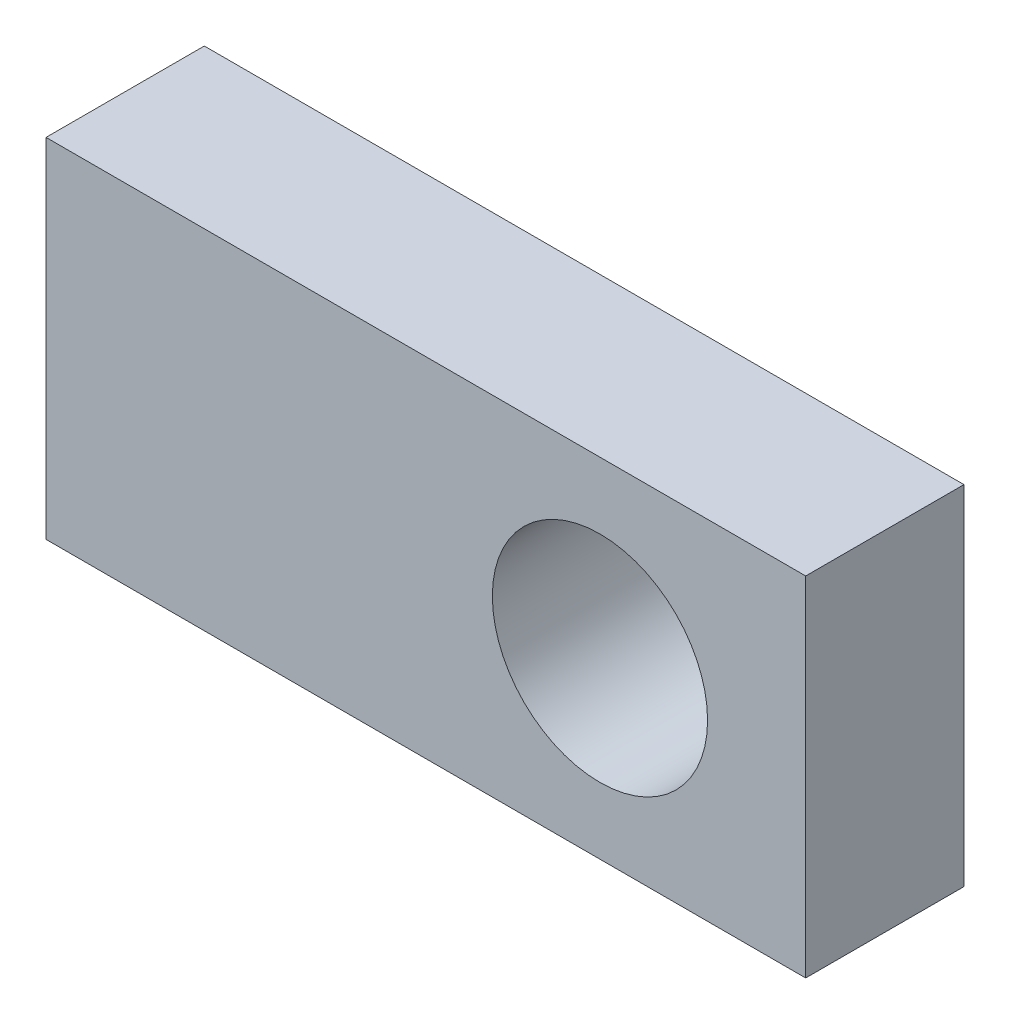
ISO-10303-21;
HEADER;
FILE_DESCRIPTION(('STEP AP214'),'2;1');
FILE_NAME('part.step','',(''),(''),'','','');
FILE_SCHEMA(('AUTOMOTIVE_DESIGN { 1 0 10303 214 1 1 1 1 }'));
ENDSEC;
DATA;
#1=APPLICATION_CONTEXT('core data for automotive mechanical design processes');
#2=APPLICATION_PROTOCOL_DEFINITION('international standard','automotive_design',2000,#1);
#3=PRODUCT_CONTEXT('',#1,'mechanical');
#4=PRODUCT('Part','Part','',(#3));
#5=PRODUCT_RELATED_PRODUCT_CATEGORY('part','',(#4));
#6=PRODUCT_DEFINITION_FORMATION('','',#4);
#7=PRODUCT_DEFINITION_CONTEXT('part definition',#1,'design');
#8=PRODUCT_DEFINITION('design','',#6,#7);
#9=PRODUCT_DEFINITION_SHAPE('','',#8);
#10=(LENGTH_UNIT() NAMED_UNIT(*) SI_UNIT(.MILLI.,.METRE.));
#11=(NAMED_UNIT(*) PLANE_ANGLE_UNIT() SI_UNIT($,.RADIAN.));
#12=(NAMED_UNIT(*) SI_UNIT($,.STERADIAN.) SOLID_ANGLE_UNIT());
#13=UNCERTAINTY_MEASURE_WITH_UNIT(LENGTH_MEASURE(1.E-05),#10,'distance_accuracy_value','');
#14=(GEOMETRIC_REPRESENTATION_CONTEXT(3) GLOBAL_UNCERTAINTY_ASSIGNED_CONTEXT((#13)) GLOBAL_UNIT_ASSIGNED_CONTEXT((#10,
#11,#12)) REPRESENTATION_CONTEXT('',''));
#15=CARTESIAN_POINT('',(0.,0.,0.));
#16=DIRECTION('',(0.,0.,1.));
#17=DIRECTION('',(1.,0.,0.));
#18=AXIS2_PLACEMENT_3D('',#15,#16,#17);
#19=CARTESIAN_POINT('',(0.,-5.49999999999999,5.));
#20=DIRECTION('',(0.,0.,-1.));
#21=DIRECTION('',(-1.,0.,0.));
#22=AXIS2_PLACEMENT_3D('',#19,#20,#21);
#23=PLANE('',#22);
#24=DIRECTION('',(0.,1.,0.));
#25=VECTOR('',#24,1.);
#26=CARTESIAN_POINT('',(0.,5.50000000000002,5.));
#27=LINE('',#26,#25);
#28=CARTESIAN_POINT('',(0.,-5.49999999999999,5.));
#29=VERTEX_POINT('',#28);
#30=CARTESIAN_POINT('',(0.,5.50000000000002,5.));
#31=VERTEX_POINT('',#30);
#32=EDGE_CURVE('E86',#29,#31,#27,.T.);
#33=ORIENTED_EDGE('',*,*,#32,.T.);
#34=DIRECTION('',(-1.,0.,0.));
#35=VECTOR('',#34,1.);
#36=CARTESIAN_POINT('',(0.,5.50000000000002,5.));
#37=LINE('',#36,#35);
#38=CARTESIAN_POINT('',(-24.,5.50000000000003,5.));
#39=VERTEX_POINT('',#38);
#40=EDGE_CURVE('E81',#31,#39,#37,.T.);
#41=ORIENTED_EDGE('',*,*,#40,.T.);
#42=DIRECTION('',(0.,-1.,0.));
#43=VECTOR('',#42,1.);
#44=CARTESIAN_POINT('',(-24.,5.50000000000003,5.));
#45=LINE('',#44,#43);
#46=CARTESIAN_POINT('',(-24.,-5.49999999999998,5.));
#47=VERTEX_POINT('',#46);
#48=EDGE_CURVE('E84',#39,#47,#45,.T.);
#49=ORIENTED_EDGE('',*,*,#48,.T.);
#50=DIRECTION('',(1.,0.,0.));
#51=VECTOR('',#50,1.);
#52=CARTESIAN_POINT('',(0.,-5.49999999999999,5.));
#53=LINE('',#52,#51);
#54=EDGE_CURVE('E51',#47,#29,#53,.T.);
#55=ORIENTED_EDGE('',*,*,#54,.T.);
#56=EDGE_LOOP('',(#33,#41,#49,#55));
#57=FACE_BOUND('',#56,.T.);
#58=CARTESIAN_POINT('',(-6.5,0.,5.));
#59=DIRECTION('',(0.,0.,1.));
#60=DIRECTION('',(1.,0.,0.));
#61=AXIS2_PLACEMENT_3D('',#58,#59,#60);
#62=CIRCLE('',#61,3.4);
#63=CARTESIAN_POINT('',(-3.1,0.,5.));
#64=VERTEX_POINT('',#63);
#65=EDGE_CURVE('E101',#64,#64,#62,.T.);
#66=ORIENTED_EDGE('',*,*,#65,.F.);
#67=EDGE_LOOP('',(#66));
#68=FACE_BOUND('',#67,.T.);
#69=ADVANCED_FACE('F34',(#57,#68),#23,.F.);
#70=CARTESIAN_POINT('',(0.,-5.49999999999999,0.));
#71=DIRECTION('',(0.,0.,-1.));
#72=DIRECTION('',(-1.,0.,0.));
#73=AXIS2_PLACEMENT_3D('',#70,#71,#72);
#74=PLANE('',#73);
#75=DIRECTION('',(0.,1.,0.));
#76=VECTOR('',#75,1.);
#77=CARTESIAN_POINT('',(0.,5.50000000000002,0.));
#78=LINE('',#77,#76);
#79=CARTESIAN_POINT('',(0.,-5.49999999999999,0.));
#80=VERTEX_POINT('',#79);
#81=CARTESIAN_POINT('',(0.,5.50000000000002,0.));
#82=VERTEX_POINT('',#81);
#83=EDGE_CURVE('E98',#80,#82,#78,.T.);
#84=ORIENTED_EDGE('',*,*,#83,.F.);
#85=DIRECTION('',(1.,0.,0.));
#86=VECTOR('',#85,1.);
#87=CARTESIAN_POINT('',(0.,-5.49999999999999,0.));
#88=LINE('',#87,#86);
#89=CARTESIAN_POINT('',(-24.,-5.49999999999998,0.));
#90=VERTEX_POINT('',#89);
#91=EDGE_CURVE('E74',#90,#80,#88,.T.);
#92=ORIENTED_EDGE('',*,*,#91,.F.);
#93=DIRECTION('',(0.,-1.,0.));
#94=VECTOR('',#93,1.);
#95=CARTESIAN_POINT('',(-24.,5.50000000000003,0.));
#96=LINE('',#95,#94);
#97=CARTESIAN_POINT('',(-24.,5.50000000000003,0.));
#98=VERTEX_POINT('',#97);
#99=EDGE_CURVE('E68',#98,#90,#96,.T.);
#100=ORIENTED_EDGE('',*,*,#99,.F.);
#101=DIRECTION('',(-1.,0.,0.));
#102=VECTOR('',#101,1.);
#103=CARTESIAN_POINT('',(0.,5.50000000000002,0.));
#104=LINE('',#103,#102);
#105=EDGE_CURVE('E90',#82,#98,#104,.T.);
#106=ORIENTED_EDGE('',*,*,#105,.F.);
#107=EDGE_LOOP('',(#84,#92,#100,#106));
#108=FACE_BOUND('',#107,.T.);
#109=CARTESIAN_POINT('',(-6.5,0.,0.));
#110=DIRECTION('',(0.,0.,1.));
#111=DIRECTION('',(1.,0.,0.));
#112=AXIS2_PLACEMENT_3D('',#109,#110,#111);
#113=CIRCLE('',#112,3.4);
#114=CARTESIAN_POINT('',(-3.1,0.,0.));
#115=VERTEX_POINT('',#114);
#116=EDGE_CURVE('E113',#115,#115,#113,.T.);
#117=ORIENTED_EDGE('',*,*,#116,.T.);
#118=EDGE_LOOP('',(#117));
#119=FACE_BOUND('',#118,.T.);
#120=ADVANCED_FACE('F109',(#108,#119),#74,.T.);
#121=CARTESIAN_POINT('',(0.,5.50000000000002,5.));
#122=DIRECTION('',(-1.,0.,0.));
#123=DIRECTION('',(0.,-1.,0.));
#124=AXIS2_PLACEMENT_3D('',#121,#122,#123);
#125=PLANE('',#124);
#126=ORIENTED_EDGE('',*,*,#83,.T.);
#127=DIRECTION('',(0.,0.,-1.));
#128=VECTOR('',#127,1.);
#129=CARTESIAN_POINT('',(0.,5.50000000000002,5.));
#130=LINE('',#129,#128);
#131=EDGE_CURVE('E11',#31,#82,#130,.T.);
#132=ORIENTED_EDGE('',*,*,#131,.F.);
#133=ORIENTED_EDGE('',*,*,#32,.F.);
#134=DIRECTION('',(0.,0.,-1.));
#135=VECTOR('',#134,1.);
#136=CARTESIAN_POINT('',(0.,-5.49999999999999,5.));
#137=LINE('',#136,#135);
#138=EDGE_CURVE('E94',#29,#80,#137,.T.);
#139=ORIENTED_EDGE('',*,*,#138,.T.);
#140=EDGE_LOOP('',(#126,#132,#133,#139));
#141=FACE_BOUND('',#140,.T.);
#142=ADVANCED_FACE('F36',(#141),#125,.F.);
#143=CARTESIAN_POINT('',(0.,5.50000000000002,5.));
#144=DIRECTION('',(0.,-1.,0.));
#145=DIRECTION('',(1.,0.,0.));
#146=AXIS2_PLACEMENT_3D('',#143,#144,#145);
#147=PLANE('',#146);
#148=ORIENTED_EDGE('',*,*,#105,.T.);
#149=DIRECTION('',(0.,0.,-1.));
#150=VECTOR('',#149,1.);
#151=CARTESIAN_POINT('',(-24.,5.50000000000003,5.));
#152=LINE('',#151,#150);
#153=EDGE_CURVE('E43',#39,#98,#152,.T.);
#154=ORIENTED_EDGE('',*,*,#153,.F.);
#155=ORIENTED_EDGE('',*,*,#40,.F.);
#156=ORIENTED_EDGE('',*,*,#131,.T.);
#157=EDGE_LOOP('',(#148,#154,#155,#156));
#158=FACE_BOUND('',#157,.T.);
#159=ADVANCED_FACE('F89',(#158),#147,.F.);
#160=CARTESIAN_POINT('',(-24.,5.50000000000003,5.));
#161=DIRECTION('',(1.,0.,0.));
#162=DIRECTION('',(0.,0.,-1.));
#163=AXIS2_PLACEMENT_3D('',#160,#161,#162);
#164=PLANE('',#163);
#165=ORIENTED_EDGE('',*,*,#99,.T.);
#166=DIRECTION('',(0.,0.,-1.));
#167=VECTOR('',#166,1.);
#168=CARTESIAN_POINT('',(-24.,-5.49999999999998,5.));
#169=LINE('',#168,#167);
#170=EDGE_CURVE('E91',#47,#90,#169,.T.);
#171=ORIENTED_EDGE('',*,*,#170,.F.);
#172=ORIENTED_EDGE('',*,*,#48,.F.);
#173=ORIENTED_EDGE('',*,*,#153,.T.);
#174=EDGE_LOOP('',(#165,#171,#172,#173));
#175=FACE_BOUND('',#174,.T.);
#176=ADVANCED_FACE('F92',(#175),#164,.F.);
#177=CARTESIAN_POINT('',(0.,-5.49999999999999,5.));
#178=DIRECTION('',(0.,1.,0.));
#179=DIRECTION('',(-1.,0.,0.));
#180=AXIS2_PLACEMENT_3D('',#177,#178,#179);
#181=PLANE('',#180);
#182=ORIENTED_EDGE('',*,*,#91,.T.);
#183=ORIENTED_EDGE('',*,*,#138,.F.);
#184=ORIENTED_EDGE('',*,*,#54,.F.);
#185=ORIENTED_EDGE('',*,*,#170,.T.);
#186=EDGE_LOOP('',(#182,#183,#184,#185));
#187=FACE_BOUND('',#186,.T.);
#188=ADVANCED_FACE('F106',(#187),#181,.F.);
#189=CARTESIAN_POINT('',(-6.5,0.,5.));
#190=DIRECTION('',(0.,0.,-1.));
#191=DIRECTION('',(-1.,0.,0.));
#192=AXIS2_PLACEMENT_3D('',#189,#190,#191);
#193=CYLINDRICAL_SURFACE('',#192,3.4);
#194=ORIENTED_EDGE('',*,*,#65,.T.);
#195=EDGE_LOOP('',(#194));
#196=FACE_BOUND('',#195,.T.);
#197=ORIENTED_EDGE('',*,*,#116,.F.);
#198=EDGE_LOOP('',(#197));
#199=FACE_BOUND('',#198,.T.);
#200=ADVANCED_FACE('F119',(#196,#199),#193,.F.);
#201=CLOSED_SHELL('',(#69,#120,#142,#159,#176,#188,#200));
#202=MANIFOLD_SOLID_BREP('B2',#201);
#203=ADVANCED_BREP_SHAPE_REPRESENTATION('',(#18,#202),#14);
#204=SHAPE_DEFINITION_REPRESENTATION(#9,#203);
ENDSEC;
END-ISO-10303-21;
